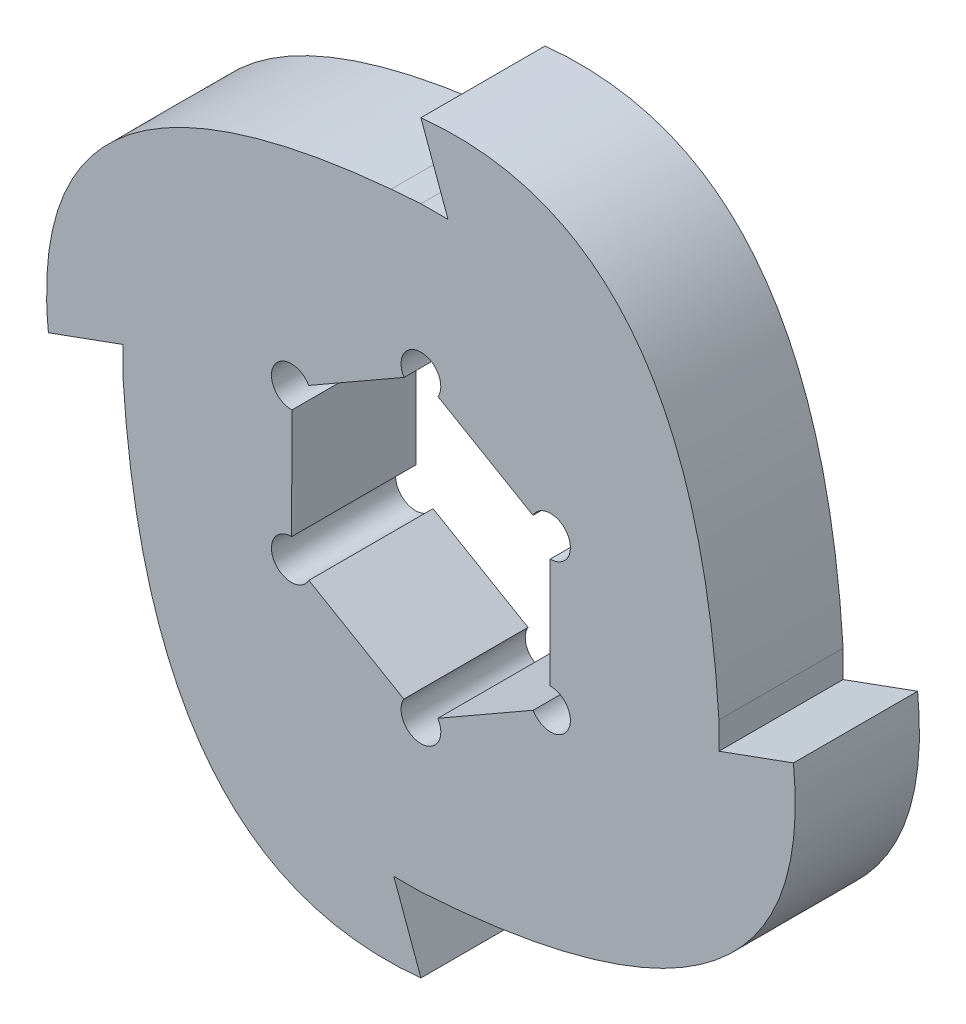
ISO-10303-21;
HEADER;
FILE_DESCRIPTION(('STEP AP214'),'2;1');
FILE_NAME('part.step','',(''),(''),'','','');
FILE_SCHEMA(('AUTOMOTIVE_DESIGN { 1 0 10303 214 1 1 1 1 }'));
ENDSEC;
DATA;
#1=APPLICATION_CONTEXT('core data for automotive mechanical design processes');
#2=APPLICATION_PROTOCOL_DEFINITION('international standard','automotive_design',2000,#1);
#3=PRODUCT_CONTEXT('',#1,'mechanical');
#4=PRODUCT('Part','Part','',(#3));
#5=PRODUCT_RELATED_PRODUCT_CATEGORY('part','',(#4));
#6=PRODUCT_DEFINITION_FORMATION('','',#4);
#7=PRODUCT_DEFINITION_CONTEXT('part definition',#1,'design');
#8=PRODUCT_DEFINITION('design','',#6,#7);
#9=PRODUCT_DEFINITION_SHAPE('','',#8);
#10=(LENGTH_UNIT() NAMED_UNIT(*) SI_UNIT(.MILLI.,.METRE.));
#11=(NAMED_UNIT(*) PLANE_ANGLE_UNIT() SI_UNIT($,.RADIAN.));
#12=(NAMED_UNIT(*) SI_UNIT($,.STERADIAN.) SOLID_ANGLE_UNIT());
#13=UNCERTAINTY_MEASURE_WITH_UNIT(LENGTH_MEASURE(1.E-05),#10,'distance_accuracy_value','');
#14=(GEOMETRIC_REPRESENTATION_CONTEXT(3) GLOBAL_UNCERTAINTY_ASSIGNED_CONTEXT((#13)) GLOBAL_UNIT_ASSIGNED_CONTEXT((#10,
#11,#12)) REPRESENTATION_CONTEXT('',''));
#15=CARTESIAN_POINT('',(0.,0.,0.));
#16=DIRECTION('',(0.,0.,1.));
#17=DIRECTION('',(1.,0.,0.));
#18=AXIS2_PLACEMENT_3D('',#15,#16,#17);
#19=CARTESIAN_POINT('',(0.,15.24,6.35));
#20=DIRECTION('',(0.,-1.,0.));
#21=DIRECTION('',(1.,0.,0.));
#22=AXIS2_PLACEMENT_3D('',#19,#20,#21);
#23=PLANE('',#22);
#24=DIRECTION('',(-1.,0.,0.));
#25=VECTOR('',#24,1.);
#26=CARTESIAN_POINT('',(0.,15.24,0.));
#27=LINE('',#26,#25);
#28=CARTESIAN_POINT('',(1.3867265925543,15.24,0.));
#29=VERTEX_POINT('',#28);
#30=CARTESIAN_POINT('',(0.,15.24,0.));
#31=VERTEX_POINT('',#30);
#32=EDGE_CURVE('E461',#29,#31,#27,.T.);
#33=ORIENTED_EDGE('',*,*,#32,.T.);
#34=DIRECTION('',(0.,0.,-1.));
#35=VECTOR('',#34,1.);
#36=CARTESIAN_POINT('',(0.,15.24,6.35));
#37=LINE('',#36,#35);
#38=CARTESIAN_POINT('',(0.,15.24,6.35));
#39=VERTEX_POINT('',#38);
#40=EDGE_CURVE('E12',#39,#31,#37,.T.);
#41=ORIENTED_EDGE('',*,*,#40,.F.);
#42=DIRECTION('',(-1.,0.,0.));
#43=VECTOR('',#42,1.);
#44=CARTESIAN_POINT('',(0.,15.24,6.35));
#45=LINE('',#44,#43);
#46=CARTESIAN_POINT('',(1.3867265925543,15.24,6.35));
#47=VERTEX_POINT('',#46);
#48=EDGE_CURVE('E659',#47,#39,#45,.T.);
#49=ORIENTED_EDGE('',*,*,#48,.F.);
#50=DIRECTION('',(0.,0.,-1.));
#51=VECTOR('',#50,1.);
#52=CARTESIAN_POINT('',(1.3867265925543,15.24,6.35));
#53=LINE('',#52,#51);
#54=EDGE_CURVE('E524',#47,#29,#53,.T.);
#55=ORIENTED_EDGE('',*,*,#54,.T.);
#56=EDGE_LOOP('',(#33,#41,#49,#55));
#57=FACE_BOUND('',#56,.T.);
#58=ADVANCED_FACE('F46',(#57),#23,.F.);
#59=CARTESIAN_POINT('',(0.,15.24,6.35));
#60=CARTESIAN_POINT('',(-20.4786192273312,13.932101613118,6.35));
#61=CARTESIAN_POINT('',(-19.05,-1.11367727944568E-13,6.35));
#62=B_SPLINE_CURVE_WITH_KNOTS('',2,(#59,#60,#61),.UNSPECIFIED.,.F.,.F.,(3,3),(0.,
0.635745988268557),.UNSPECIFIED.);
#63=DIRECTION('',(0.,0.,-1.));
#64=VECTOR('',#63,1.);
#65=SURFACE_OF_LINEAR_EXTRUSION('',#62,#64);
#66=CARTESIAN_POINT('',(0.,15.24,0.));
#67=CARTESIAN_POINT('',(-20.4786192273312,13.932101613118,0.));
#68=CARTESIAN_POINT('',(-19.05,-1.11367727944568E-13,0.));
#69=B_SPLINE_CURVE_WITH_KNOTS('',2,(#66,#67,#68),.UNSPECIFIED.,.F.,.F.,(3,3),(0.,
0.635745988268557),.UNSPECIFIED.);
#70=CARTESIAN_POINT('',(-1.52416502366941,15.1224227793508,0.));
#71=VERTEX_POINT('',#70);
#72=EDGE_CURVE('E465',#31,#71,#69,.T.);
#73=ORIENTED_EDGE('',*,*,#72,.T.);
#74=DIRECTION('',(0.,0.,-1.));
#75=VECTOR('',#74,1.);
#76=CARTESIAN_POINT('',(-1.52416502366941,15.1224227793508,6.35));
#77=LINE('',#76,#75);
#78=CARTESIAN_POINT('',(-1.52416502366941,15.1224227793508,6.35));
#79=VERTEX_POINT('',#78);
#80=EDGE_CURVE('E57',#79,#71,#77,.T.);
#81=ORIENTED_EDGE('',*,*,#80,.F.);
#82=EDGE_CURVE('E337',#39,#79,#62,.T.);
#83=ORIENTED_EDGE('',*,*,#82,.F.);
#84=ORIENTED_EDGE('',*,*,#40,.T.);
#85=EDGE_LOOP('',(#73,#81,#83,#84));
#86=FACE_BOUND('',#85,.T.);
#87=ADVANCED_FACE('F351',(#86),#65,.F.);
#88=CARTESIAN_POINT('',(-1.52416502366941,15.1224227793508,6.35));
#89=CARTESIAN_POINT('',(-14.1242901003145,13.9760649135802,6.35));
#90=CARTESIAN_POINT('',(-19.9662350924247,8.93525732046324,6.35));
#91=CARTESIAN_POINT('',(-19.05,0.,6.35));
#92=B_SPLINE_CURVE_WITH_KNOTS('',3,(#88,#89,#90,#91),.UNSPECIFIED.,.F.,.F.,(4,4),
(0.0241490282360042,0.635745988268557),.UNSPECIFIED.);
#93=DIRECTION('',(0.,0.,-1.));
#94=VECTOR('',#93,1.);
#95=SURFACE_OF_LINEAR_EXTRUSION('',#92,#94);
#96=CARTESIAN_POINT('',(-1.52416502366941,15.1224227793508,0.));
#97=CARTESIAN_POINT('',(-14.1242901003145,13.9760649135802,0.));
#98=CARTESIAN_POINT('',(-19.9662350924247,8.93525732046324,0.));
#99=CARTESIAN_POINT('',(-19.05,0.,0.));
#100=B_SPLINE_CURVE_WITH_KNOTS('',3,(#96,#97,#98,#99),.UNSPECIFIED.,.F.,.F.,(4,4),
(0.0241490282360042,0.635745988268557),.UNSPECIFIED.);
#101=CARTESIAN_POINT('',(-19.05,0.,0.));
#102=VERTEX_POINT('',#101);
#103=EDGE_CURVE('E470',#71,#102,#100,.T.);
#104=ORIENTED_EDGE('',*,*,#103,.T.);
#105=DIRECTION('',(0.,0.,-1.));
#106=VECTOR('',#105,1.);
#107=CARTESIAN_POINT('',(-19.05,0.,6.35));
#108=LINE('',#107,#106);
#109=CARTESIAN_POINT('',(-19.05,0.,6.35));
#110=VERTEX_POINT('',#109);
#111=EDGE_CURVE('E555',#110,#102,#108,.T.);
#112=ORIENTED_EDGE('',*,*,#111,.F.);
#113=EDGE_CURVE('E331',#79,#110,#92,.T.);
#114=ORIENTED_EDGE('',*,*,#113,.F.);
#115=ORIENTED_EDGE('',*,*,#80,.T.);
#116=EDGE_LOOP('',(#104,#112,#114,#115));
#117=FACE_BOUND('',#116,.T.);
#118=ADVANCED_FACE('F347',(#117),#95,.F.);
#119=CARTESIAN_POINT('',(-2.22842667929179,6.12255198226435,6.35));
#120=DIRECTION('',(-0.342020143325673,0.939692620785907,0.));
#121=DIRECTION('',(-0.939692620785907,-0.342020143325673,0.));
#122=AXIS2_PLACEMENT_3D('',#119,#120,#121);
#123=PLANE('',#122);
#124=DIRECTION('',(0.939692620785907,0.342020143325673,0.));
#125=VECTOR('',#124,1.);
#126=CARTESIAN_POINT('',(-2.22842667929179,6.12255198226435,0.));
#127=LINE('',#126,#125);
#128=CARTESIAN_POINT('',(-15.24,1.38672659255425,0.));
#129=VERTEX_POINT('',#128);
#130=EDGE_CURVE('E478',#102,#129,#127,.T.);
#131=ORIENTED_EDGE('',*,*,#130,.T.);
#132=DIRECTION('',(0.,0.,-1.));
#133=VECTOR('',#132,1.);
#134=CARTESIAN_POINT('',(-15.24,1.38672659255425,6.35));
#135=LINE('',#134,#133);
#136=CARTESIAN_POINT('',(-15.24,1.38672659255425,6.35));
#137=VERTEX_POINT('',#136);
#138=EDGE_CURVE('E551',#137,#129,#135,.T.);
#139=ORIENTED_EDGE('',*,*,#138,.F.);
#140=DIRECTION('',(0.939692620785907,0.342020143325673,0.));
#141=VECTOR('',#140,1.);
#142=CARTESIAN_POINT('',(-2.22842667929179,6.12255198226435,6.35));
#143=LINE('',#142,#141);
#144=EDGE_CURVE('E328',#110,#137,#143,.T.);
#145=ORIENTED_EDGE('',*,*,#144,.F.);
#146=ORIENTED_EDGE('',*,*,#111,.T.);
#147=EDGE_LOOP('',(#131,#139,#145,#146));
#148=FACE_BOUND('',#147,.T.);
#149=ADVANCED_FACE('F350',(#148),#123,.F.);
#150=CARTESIAN_POINT('',(-15.24,0.,6.35));
#151=DIRECTION('',(1.,0.,0.));
#152=DIRECTION('',(0.,1.,0.));
#153=AXIS2_PLACEMENT_3D('',#150,#151,#152);
#154=PLANE('',#153);
#155=DIRECTION('',(0.,-1.,0.));
#156=VECTOR('',#155,1.);
#157=CARTESIAN_POINT('',(-15.24,0.,0.));
#158=LINE('',#157,#156);
#159=CARTESIAN_POINT('',(-15.24,0.,0.));
#160=VERTEX_POINT('',#159);
#161=EDGE_CURVE('E484',#129,#160,#158,.T.);
#162=ORIENTED_EDGE('',*,*,#161,.T.);
#163=DIRECTION('',(0.,0.,-1.));
#164=VECTOR('',#163,1.);
#165=CARTESIAN_POINT('',(-15.24,0.,6.35));
#166=LINE('',#165,#164);
#167=CARTESIAN_POINT('',(-15.24,0.,6.35));
#168=VERTEX_POINT('',#167);
#169=EDGE_CURVE('E547',#168,#160,#166,.T.);
#170=ORIENTED_EDGE('',*,*,#169,.F.);
#171=DIRECTION('',(0.,-1.,0.));
#172=VECTOR('',#171,1.);
#173=CARTESIAN_POINT('',(-15.24,0.,6.35));
#174=LINE('',#173,#172);
#175=EDGE_CURVE('E313',#137,#168,#174,.T.);
#176=ORIENTED_EDGE('',*,*,#175,.F.);
#177=ORIENTED_EDGE('',*,*,#138,.T.);
#178=EDGE_LOOP('',(#162,#170,#176,#177));
#179=FACE_BOUND('',#178,.T.);
#180=ADVANCED_FACE('F303',(#179),#154,.F.);
#181=CARTESIAN_POINT('',(-15.24,0.,6.35));
#182=CARTESIAN_POINT('',(-13.932101613118,-20.4786192273313,6.35));
#183=CARTESIAN_POINT('',(1.11367727944568E-13,-19.05,6.35));
#184=B_SPLINE_CURVE_WITH_KNOTS('',2,(#181,#182,#183),.UNSPECIFIED.,.F.,.F.,(3,3),(0.,
0.635745988268557),.UNSPECIFIED.);
#185=DIRECTION('',(0.,0.,-1.));
#186=VECTOR('',#185,1.);
#187=SURFACE_OF_LINEAR_EXTRUSION('',#184,#186);
#188=CARTESIAN_POINT('',(-15.24,0.,0.));
#189=CARTESIAN_POINT('',(-13.932101613118,-20.4786192273313,0.));
#190=CARTESIAN_POINT('',(1.11367727944568E-13,-19.05,0.));
#191=B_SPLINE_CURVE_WITH_KNOTS('',2,(#188,#189,#190),.UNSPECIFIED.,.F.,.F.,(3,3),(0.,
0.635745988268557),.UNSPECIFIED.);
#192=CARTESIAN_POINT('',(0.,-19.05,0.));
#193=VERTEX_POINT('',#192);
#194=EDGE_CURVE('E487',#160,#193,#191,.T.);
#195=ORIENTED_EDGE('',*,*,#194,.T.);
#196=DIRECTION('',(0.,0.,-1.));
#197=VECTOR('',#196,1.);
#198=CARTESIAN_POINT('',(0.,-19.05,6.35));
#199=LINE('',#198,#197);
#200=CARTESIAN_POINT('',(0.,-19.05,6.35));
#201=VERTEX_POINT('',#200);
#202=EDGE_CURVE('E543',#201,#193,#199,.T.);
#203=ORIENTED_EDGE('',*,*,#202,.F.);
#204=EDGE_CURVE('E306',#168,#201,#184,.T.);
#205=ORIENTED_EDGE('',*,*,#204,.F.);
#206=ORIENTED_EDGE('',*,*,#169,.T.);
#207=EDGE_LOOP('',(#195,#203,#205,#206));
#208=FACE_BOUND('',#207,.T.);
#209=ADVANCED_FACE('F298',(#208),#187,.F.);
#210=CARTESIAN_POINT('',(-6.12255198226488,-2.22842667929223,6.35));
#211=DIRECTION('',(-0.939692620785894,-0.342020143325707,0.));
#212=DIRECTION('',(0.342020143325707,-0.939692620785895,0.));
#213=AXIS2_PLACEMENT_3D('',#210,#211,#212);
#214=PLANE('',#213);
#215=DIRECTION('',(-0.342020143325707,0.939692620785894,0.));
#216=VECTOR('',#215,1.);
#217=CARTESIAN_POINT('',(-6.12255198226488,-2.22842667929223,0.));
#218=LINE('',#217,#216);
#219=CARTESIAN_POINT('',(-1.38672659255441,-15.24,0.));
#220=VERTEX_POINT('',#219);
#221=EDGE_CURVE('E492',#193,#220,#218,.T.);
#222=ORIENTED_EDGE('',*,*,#221,.T.);
#223=DIRECTION('',(0.,0.,-1.));
#224=VECTOR('',#223,1.);
#225=CARTESIAN_POINT('',(-1.38672659255441,-15.24,6.35));
#226=LINE('',#225,#224);
#227=CARTESIAN_POINT('',(-1.38672659255441,-15.24,6.35));
#228=VERTEX_POINT('',#227);
#229=EDGE_CURVE('E539',#228,#220,#226,.T.);
#230=ORIENTED_EDGE('',*,*,#229,.F.);
#231=DIRECTION('',(-0.342020143325707,0.939692620785894,0.));
#232=VECTOR('',#231,1.);
#233=CARTESIAN_POINT('',(-6.12255198226488,-2.22842667929223,6.35));
#234=LINE('',#233,#232);
#235=EDGE_CURVE('E312',#201,#228,#234,.T.);
#236=ORIENTED_EDGE('',*,*,#235,.F.);
#237=ORIENTED_EDGE('',*,*,#202,.T.);
#238=EDGE_LOOP('',(#222,#230,#236,#237));
#239=FACE_BOUND('',#238,.T.);
#240=ADVANCED_FACE('F294',(#239),#214,.F.);
#241=CARTESIAN_POINT('',(-1.71580088852786E-13,-15.24,6.35));
#242=DIRECTION('',(0.,1.,0.));
#243=DIRECTION('',(-1.,0.,0.));
#244=AXIS2_PLACEMENT_3D('',#241,#242,#243);
#245=PLANE('',#244);
#246=DIRECTION('',(1.,0.,0.));
#247=VECTOR('',#246,1.);
#248=CARTESIAN_POINT('',(-1.71580088852786E-13,-15.24,0.));
#249=LINE('',#248,#247);
#250=CARTESIAN_POINT('',(-1.59630525227281E-13,-15.24,0.));
#251=VERTEX_POINT('',#250);
#252=EDGE_CURVE('E498',#220,#251,#249,.T.);
#253=ORIENTED_EDGE('',*,*,#252,.T.);
#254=DIRECTION('',(0.,0.,-1.));
#255=VECTOR('',#254,1.);
#256=CARTESIAN_POINT('',(-1.59630525227281E-13,-15.24,6.35));
#257=LINE('',#256,#255);
#258=CARTESIAN_POINT('',(-1.59630525227281E-13,-15.24,6.35));
#259=VERTEX_POINT('',#258);
#260=EDGE_CURVE('E535',#259,#251,#257,.T.);
#261=ORIENTED_EDGE('',*,*,#260,.F.);
#262=DIRECTION('',(1.,0.,0.));
#263=VECTOR('',#262,1.);
#264=CARTESIAN_POINT('',(-1.71580088852786E-13,-15.24,6.35));
#265=LINE('',#264,#263);
#266=EDGE_CURVE('E277',#228,#259,#265,.T.);
#267=ORIENTED_EDGE('',*,*,#266,.F.);
#268=ORIENTED_EDGE('',*,*,#229,.T.);
#269=EDGE_LOOP('',(#253,#261,#267,#268));
#270=FACE_BOUND('',#269,.T.);
#271=ADVANCED_FACE('F290',(#270),#245,.F.);
#272=CARTESIAN_POINT('',(0.,-15.24,6.35));
#273=CARTESIAN_POINT('',(20.4786192273311,-13.932101613118,6.35));
#274=CARTESIAN_POINT('',(19.05,1.11952145140775E-13,6.35));
#275=B_SPLINE_CURVE_WITH_KNOTS('',2,(#272,#273,#274),.UNSPECIFIED.,.F.,.F.,(3,3),(0.,
0.635745988268557),.UNSPECIFIED.);
#276=DIRECTION('',(0.,0.,-1.));
#277=VECTOR('',#276,1.);
#278=SURFACE_OF_LINEAR_EXTRUSION('',#275,#277);
#279=CARTESIAN_POINT('',(0.,-15.24,0.));
#280=CARTESIAN_POINT('',(20.4786192273311,-13.932101613118,0.));
#281=CARTESIAN_POINT('',(19.05,1.11952145140775E-13,0.));
#282=B_SPLINE_CURVE_WITH_KNOTS('',2,(#279,#280,#281),.UNSPECIFIED.,.F.,.F.,(3,3),(0.,
0.635745988268557),.UNSPECIFIED.);
#283=CARTESIAN_POINT('',(19.05,0.,0.));
#284=VERTEX_POINT('',#283);
#285=EDGE_CURVE('E501',#251,#284,#282,.T.);
#286=ORIENTED_EDGE('',*,*,#285,.T.);
#287=DIRECTION('',(0.,0.,-1.));
#288=VECTOR('',#287,1.);
#289=CARTESIAN_POINT('',(19.05,0.,6.35));
#290=LINE('',#289,#288);
#291=CARTESIAN_POINT('',(19.05,0.,6.35));
#292=VERTEX_POINT('',#291);
#293=EDGE_CURVE('E531',#292,#284,#290,.T.);
#294=ORIENTED_EDGE('',*,*,#293,.F.);
#295=EDGE_CURVE('E271',#259,#292,#275,.T.);
#296=ORIENTED_EDGE('',*,*,#295,.F.);
#297=ORIENTED_EDGE('',*,*,#260,.T.);
#298=EDGE_LOOP('',(#286,#294,#296,#297));
#299=FACE_BOUND('',#298,.T.);
#300=ADVANCED_FACE('F285',(#299),#278,.F.);
#301=CARTESIAN_POINT('',(2.22842667929208,-6.1225519822647,6.35));
#302=DIRECTION('',(0.342020143325696,-0.939692620785899,0.));
#303=DIRECTION('',(0.939692620785899,0.342020143325696,0.));
#304=AXIS2_PLACEMENT_3D('',#301,#302,#303);
#305=PLANE('',#304);
#306=DIRECTION('',(-0.939692620785899,-0.342020143325696,0.));
#307=VECTOR('',#306,1.);
#308=CARTESIAN_POINT('',(2.22842667929208,-6.1225519822647,0.));
#309=LINE('',#308,#307);
#310=CARTESIAN_POINT('',(15.24,-1.38672659255436,0.));
#311=VERTEX_POINT('',#310);
#312=EDGE_CURVE('E506',#284,#311,#309,.T.);
#313=ORIENTED_EDGE('',*,*,#312,.T.);
#314=DIRECTION('',(0.,0.,-1.));
#315=VECTOR('',#314,1.);
#316=CARTESIAN_POINT('',(15.24,-1.38672659255436,6.35));
#317=LINE('',#316,#315);
#318=CARTESIAN_POINT('',(15.24,-1.38672659255436,6.35));
#319=VERTEX_POINT('',#318);
#320=EDGE_CURVE('E242',#319,#311,#317,.T.);
#321=ORIENTED_EDGE('',*,*,#320,.F.);
#322=DIRECTION('',(-0.939692620785899,-0.342020143325696,0.));
#323=VECTOR('',#322,1.);
#324=CARTESIAN_POINT('',(2.22842667929208,-6.1225519822647,6.35));
#325=LINE('',#324,#323);
#326=EDGE_CURVE('E231',#292,#319,#325,.T.);
#327=ORIENTED_EDGE('',*,*,#326,.F.);
#328=ORIENTED_EDGE('',*,*,#293,.T.);
#329=EDGE_LOOP('',(#313,#321,#327,#328));
#330=FACE_BOUND('',#329,.T.);
#331=ADVANCED_FACE('F289',(#330),#305,.F.);
#332=CARTESIAN_POINT('',(15.24,-1.33451180218833E-13,6.35));
#333=DIRECTION('',(-1.,0.,0.));
#334=DIRECTION('',(0.,-1.,0.));
#335=AXIS2_PLACEMENT_3D('',#332,#333,#334);
#336=PLANE('',#335);
#337=DIRECTION('',(0.,1.,0.));
#338=VECTOR('',#337,1.);
#339=CARTESIAN_POINT('',(15.24,-1.33451180218833E-13,0.));
#340=LINE('',#339,#338);
#341=CARTESIAN_POINT('',(15.24,-1.06420353786144E-13,0.));
#342=VERTEX_POINT('',#341);
#343=EDGE_CURVE('E240',#311,#342,#340,.T.);
#344=ORIENTED_EDGE('',*,*,#343,.T.);
#345=DIRECTION('',(0.,0.,-1.));
#346=VECTOR('',#345,1.);
#347=CARTESIAN_POINT('',(15.24,-1.06420353786144E-13,6.35));
#348=LINE('',#347,#346);
#349=CARTESIAN_POINT('',(15.24,-1.06420353786144E-13,6.35));
#350=VERTEX_POINT('',#349);
#351=EDGE_CURVE('E237',#350,#342,#348,.T.);
#352=ORIENTED_EDGE('',*,*,#351,.F.);
#353=DIRECTION('',(0.,1.,0.));
#354=VECTOR('',#353,1.);
#355=CARTESIAN_POINT('',(15.24,-1.33451180218833E-13,6.35));
#356=LINE('',#355,#354);
#357=EDGE_CURVE('E225',#319,#350,#356,.T.);
#358=ORIENTED_EDGE('',*,*,#357,.F.);
#359=ORIENTED_EDGE('',*,*,#320,.T.);
#360=EDGE_LOOP('',(#344,#352,#358,#359));
#361=FACE_BOUND('',#360,.T.);
#362=ADVANCED_FACE('F238',(#361),#336,.F.);
#363=CARTESIAN_POINT('',(15.24,0.,6.35));
#364=CARTESIAN_POINT('',(13.932101613118,20.4786192273312,6.35));
#365=CARTESIAN_POINT('',(-1.1428509729315E-13,19.05,6.35));
#366=B_SPLINE_CURVE_WITH_KNOTS('',2,(#363,#364,#365),.UNSPECIFIED.,.F.,.F.,(3,3),(0.,
0.635745988268557),.UNSPECIFIED.);
#367=DIRECTION('',(0.,0.,-1.));
#368=VECTOR('',#367,1.);
#369=SURFACE_OF_LINEAR_EXTRUSION('',#366,#368);
#370=CARTESIAN_POINT('',(15.24,0.,0.));
#371=CARTESIAN_POINT('',(13.932101613118,20.4786192273312,0.));
#372=CARTESIAN_POINT('',(-1.1428509729315E-13,19.05,0.));
#373=B_SPLINE_CURVE_WITH_KNOTS('',2,(#370,#371,#372),.UNSPECIFIED.,.F.,.F.,(3,3),(0.,
0.635745988268557),.UNSPECIFIED.);
#374=CARTESIAN_POINT('',(0.,19.05,0.));
#375=VERTEX_POINT('',#374);
#376=EDGE_CURVE('E146',#342,#375,#373,.T.);
#377=ORIENTED_EDGE('',*,*,#376,.T.);
#378=DIRECTION('',(0.,0.,-1.));
#379=VECTOR('',#378,1.);
#380=CARTESIAN_POINT('',(0.,19.05,6.35));
#381=LINE('',#380,#379);
#382=CARTESIAN_POINT('',(0.,19.05,6.35));
#383=VERTEX_POINT('',#382);
#384=EDGE_CURVE('E243',#383,#375,#381,.T.);
#385=ORIENTED_EDGE('',*,*,#384,.F.);
#386=EDGE_CURVE('E229',#350,#383,#366,.T.);
#387=ORIENTED_EDGE('',*,*,#386,.F.);
#388=ORIENTED_EDGE('',*,*,#351,.T.);
#389=EDGE_LOOP('',(#377,#385,#387,#388));
#390=FACE_BOUND('',#389,.T.);
#391=ADVANCED_FACE('F245',(#390),#369,.F.);
#392=CARTESIAN_POINT('',(-6.62767759118328,-3.82649144137171,6.35));
#393=DIRECTION('',(0.,0.,-1.));
#394=DIRECTION('',(-1.,0.,0.));
#395=AXIS2_PLACEMENT_3D('',#392,#393,#394);
#396=CYLINDRICAL_SURFACE('',#395,1.016);
#397=CARTESIAN_POINT('',(-6.62767759118328,-3.82649144137171,0.));
#398=DIRECTION('',(0.,0.,1.));
#399=DIRECTION('',(1.,0.,0.));
#400=AXIS2_PLACEMENT_3D('',#397,#398,#399);
#401=CIRCLE('',#400,1.016);
#402=CARTESIAN_POINT('',(-6.61308201311803,-2.81059628482211,0.));
#403=VERTEX_POINT('',#402);
#404=CARTESIAN_POINT('',(-5.73190515362489,-4.30591582551451,0.));
#405=VERTEX_POINT('',#404);
#406=EDGE_CURVE('E416',#403,#405,#401,.T.);
#407=ORIENTED_EDGE('',*,*,#406,.F.);
#408=DIRECTION('',(0.,0.,-1.));
#409=VECTOR('',#408,1.);
#410=CARTESIAN_POINT('',(-6.61308201311803,-2.81059628482211,6.35));
#411=LINE('',#410,#409);
#412=CARTESIAN_POINT('',(-6.61308201311803,-2.81059628482211,6.35));
#413=VERTEX_POINT('',#412);
#414=EDGE_CURVE('E50',#413,#403,#411,.T.);
#415=ORIENTED_EDGE('',*,*,#414,.F.);
#416=CARTESIAN_POINT('',(-6.62767759118328,-3.82649144137171,6.35));
#417=DIRECTION('',(0.,0.,1.));
#418=DIRECTION('',(1.,0.,0.));
#419=AXIS2_PLACEMENT_3D('',#416,#417,#418);
#420=CIRCLE('',#419,1.016);
#421=CARTESIAN_POINT('',(-5.73190515362489,-4.30591582551451,6.35));
#422=VERTEX_POINT('',#421);
#423=EDGE_CURVE('E523',#413,#422,#420,.T.);
#424=ORIENTED_EDGE('',*,*,#423,.T.);
#425=DIRECTION('',(0.,0.,-1.));
#426=VECTOR('',#425,1.);
#427=CARTESIAN_POINT('',(-5.73190515362489,-4.30591582551451,6.35));
#428=LINE('',#427,#426);
#429=EDGE_CURVE('E249',#422,#405,#428,.T.);
#430=ORIENTED_EDGE('',*,*,#429,.T.);
#431=EDGE_LOOP('',(#407,#415,#424,#430));
#432=FACE_BOUND('',#431,.T.);
#433=ADVANCED_FACE('F48',(#432),#396,.F.);
#434=CARTESIAN_POINT('',(-6.60396578140302,0.0212593052107521,6.35));
#435=DIRECTION('',(0.999994818504394,-0.00321915584657058,0.));
#436=DIRECTION('',(0.00321915584657058,0.999994818504394,0.));
#437=AXIS2_PLACEMENT_3D('',#434,#435,#436);
#438=PLANE('',#437);
#439=DIRECTION('',(-0.00321915584657058,-0.999994818504394,0.));
#440=VECTOR('',#439,1.);
#441=CARTESIAN_POINT('',(-6.60396578140302,0.0212593052107521,0.));
#442=LINE('',#441,#440);
#443=CARTESIAN_POINT('',(-6.59498506826546,2.81101756236484,0.));
#444=VERTEX_POINT('',#443);
#445=EDGE_CURVE('E407',#444,#403,#442,.T.);
#446=ORIENTED_EDGE('',*,*,#445,.F.);
#447=DIRECTION('',(0.,0.,-1.));
#448=VECTOR('',#447,1.);
#449=CARTESIAN_POINT('',(-6.59498506826546,2.81101756236484,6.35));
#450=LINE('',#449,#448);
#451=CARTESIAN_POINT('',(-6.59498506826546,2.81101756236484,6.35));
#452=VERTEX_POINT('',#451);
#453=EDGE_CURVE('E410',#452,#444,#450,.T.);
#454=ORIENTED_EDGE('',*,*,#453,.F.);
#455=DIRECTION('',(-0.00321915584657058,-0.999994818504394,0.));
#456=VECTOR('',#455,1.);
#457=CARTESIAN_POINT('',(-6.60396578140302,0.0212593052107521,6.35));
#458=LINE('',#457,#456);
#459=EDGE_CURVE('E600',#452,#413,#458,.T.);
#460=ORIENTED_EDGE('',*,*,#459,.T.);
#461=ORIENTED_EDGE('',*,*,#414,.T.);
#462=EDGE_LOOP('',(#446,#454,#460,#461));
#463=FACE_BOUND('',#462,.T.);
#464=ADVANCED_FACE('F398',(#463),#438,.T.);
#465=CARTESIAN_POINT('',(-6.62767759118329,3.82649144137171,6.35));
#466=DIRECTION('',(0.,0.,-1.));
#467=DIRECTION('',(-1.,0.,0.));
#468=AXIS2_PLACEMENT_3D('',#465,#466,#467);
#469=CYLINDRICAL_SURFACE('',#468,1.016);
#470=CARTESIAN_POINT('',(-6.62767759118329,3.82649144137171,0.));
#471=DIRECTION('',(0.,0.,1.));
#472=DIRECTION('',(1.,0.,0.));
#473=AXIS2_PLACEMENT_3D('',#470,#471,#472);
#474=CIRCLE('',#473,1.016);
#475=CARTESIAN_POINT('',(-5.74058878899713,4.32179887825908,0.));
#476=VERTEX_POINT('',#475);
#477=EDGE_CURVE('E415',#476,#444,#474,.T.);
#478=ORIENTED_EDGE('',*,*,#477,.F.);
#479=DIRECTION('',(0.,0.,-1.));
#480=VECTOR('',#479,1.);
#481=CARTESIAN_POINT('',(-5.74058878899713,4.32179887825908,6.35));
#482=LINE('',#481,#480);
#483=CARTESIAN_POINT('',(-5.74058878899713,4.32179887825908,6.35));
#484=VERTEX_POINT('',#483);
#485=EDGE_CURVE('E588',#484,#476,#482,.T.);
#486=ORIENTED_EDGE('',*,*,#485,.F.);
#487=CARTESIAN_POINT('',(-6.62767759118329,3.82649144137171,6.35));
#488=DIRECTION('',(0.,0.,1.));
#489=DIRECTION('',(1.,0.,0.));
#490=AXIS2_PLACEMENT_3D('',#487,#488,#489);
#491=CIRCLE('',#490,1.016);
#492=EDGE_CURVE('E594',#484,#452,#491,.T.);
#493=ORIENTED_EDGE('',*,*,#492,.T.);
#494=ORIENTED_EDGE('',*,*,#453,.T.);
#495=EDGE_LOOP('',(#478,#486,#493,#494));
#496=FACE_BOUND('',#495,.T.);
#497=ADVANCED_FACE('F395',(#496),#469,.F.);
#498=CARTESIAN_POINT('',(-3.28357179232219,5.72983178502353,6.35));
#499=DIRECTION('',(0.497209538510327,-0.867630494400899,0.));
#500=DIRECTION('',(0.867630494400899,0.497209538510327,0.));
#501=AXIS2_PLACEMENT_3D('',#498,#499,#500);
#502=PLANE('',#501);
#503=DIRECTION('',(-0.867630494400899,-0.497209538510327,0.));
#504=VECTOR('',#503,1.);
#505=CARTESIAN_POINT('',(-3.28357179232219,5.72983178502353,0.));
#506=LINE('',#505,#504);
#507=CARTESIAN_POINT('',(-0.863079914640567,7.11693338787935,0.));
#508=VERTEX_POINT('',#507);
#509=EDGE_CURVE('E424',#508,#476,#506,.T.);
#510=ORIENTED_EDGE('',*,*,#509,.F.);
#511=DIRECTION('',(0.,0.,-1.));
#512=VECTOR('',#511,1.);
#513=CARTESIAN_POINT('',(-0.863079914640567,7.11693338787935,6.35));
#514=LINE('',#513,#512);
#515=CARTESIAN_POINT('',(-0.863079914640567,7.11693338787935,6.35));
#516=VERTEX_POINT('',#515);
#517=EDGE_CURVE('E585',#516,#508,#514,.T.);
#518=ORIENTED_EDGE('',*,*,#517,.F.);
#519=DIRECTION('',(-0.867630494400899,-0.497209538510327,0.));
#520=VECTOR('',#519,1.);
#521=CARTESIAN_POINT('',(-3.28357179232219,5.72983178502353,6.35));
#522=LINE('',#521,#520);
#523=EDGE_CURVE('E599',#516,#484,#522,.T.);
#524=ORIENTED_EDGE('',*,*,#523,.T.);
#525=ORIENTED_EDGE('',*,*,#485,.T.);
#526=EDGE_LOOP('',(#510,#518,#524,#525));
#527=FACE_BOUND('',#526,.T.);
#528=ADVANCED_FACE('F391',(#527),#502,.T.);
#529=CARTESIAN_POINT('',(0.,7.65298288274344,6.35));
#530=DIRECTION('',(0.,0.,-1.));
#531=DIRECTION('',(-1.,0.,0.));
#532=AXIS2_PLACEMENT_3D('',#529,#530,#531);
#533=CYLINDRICAL_SURFACE('',#532,1.016);
#534=CARTESIAN_POINT('',(0.,7.65298288274344,0.));
#535=DIRECTION('',(0.,0.,1.));
#536=DIRECTION('',(1.,0.,0.));
#537=AXIS2_PLACEMENT_3D('',#534,#535,#536);
#538=CIRCLE('',#537,1.016);
#539=CARTESIAN_POINT('',(0.87249322412089,7.13239516308121,0.));
#540=VERTEX_POINT('',#539);
#541=EDGE_CURVE('E428',#540,#508,#538,.T.);
#542=ORIENTED_EDGE('',*,*,#541,.F.);
#543=DIRECTION('',(0.,0.,-1.));
#544=VECTOR('',#543,1.);
#545=CARTESIAN_POINT('',(0.87249322412089,7.13239516308121,6.35));
#546=LINE('',#545,#544);
#547=CARTESIAN_POINT('',(0.87249322412089,7.13239516308121,6.35));
#548=VERTEX_POINT('',#547);
#549=EDGE_CURVE('E582',#548,#540,#546,.T.);
#550=ORIENTED_EDGE('',*,*,#549,.F.);
#551=CARTESIAN_POINT('',(0.,7.65298288274344,6.35));
#552=DIRECTION('',(0.,0.,1.));
#553=DIRECTION('',(1.,0.,0.));
#554=AXIS2_PLACEMENT_3D('',#551,#552,#553);
#555=CIRCLE('',#554,1.016);
#556=EDGE_CURVE('E604',#548,#516,#555,.T.);
#557=ORIENTED_EDGE('',*,*,#556,.T.);
#558=ORIENTED_EDGE('',*,*,#517,.T.);
#559=EDGE_LOOP('',(#542,#550,#557,#558));
#560=FACE_BOUND('',#559,.T.);
#561=ADVANCED_FACE('F387',(#560),#533,.F.);
#562=CARTESIAN_POINT('',(3.32039398908082,5.70857247981279,6.35));
#563=DIRECTION('',(-0.502785279994067,-0.864411338554329,0.));
#564=DIRECTION('',(0.86441133855433,-0.502785279994067,0.));
#565=AXIS2_PLACEMENT_3D('',#562,#563,#564);
#566=PLANE('',#565);
#567=DIRECTION('',(-0.864411338554329,0.502785279994067,0.));
#568=VECTOR('',#567,1.);
#569=CARTESIAN_POINT('',(3.32039398908082,5.70857247981279,0.));
#570=LINE('',#569,#568);
#571=CARTESIAN_POINT('',(5.73190515362489,4.30591582551452,0.));
#572=VERTEX_POINT('',#571);
#573=EDGE_CURVE('E433',#572,#540,#570,.T.);
#574=ORIENTED_EDGE('',*,*,#573,.F.);
#575=DIRECTION('',(0.,0.,-1.));
#576=VECTOR('',#575,1.);
#577=CARTESIAN_POINT('',(5.73190515362489,4.30591582551452,6.35));
#578=LINE('',#577,#576);
#579=CARTESIAN_POINT('',(5.73190515362489,4.30591582551452,6.35));
#580=VERTEX_POINT('',#579);
#581=EDGE_CURVE('E579',#580,#572,#578,.T.);
#582=ORIENTED_EDGE('',*,*,#581,.F.);
#583=DIRECTION('',(-0.864411338554329,0.502785279994067,0.));
#584=VECTOR('',#583,1.);
#585=CARTESIAN_POINT('',(3.32039398908082,5.70857247981279,6.35));
#586=LINE('',#585,#584);
#587=EDGE_CURVE('E623',#580,#548,#586,.T.);
#588=ORIENTED_EDGE('',*,*,#587,.T.);
#589=ORIENTED_EDGE('',*,*,#549,.T.);
#590=EDGE_LOOP('',(#574,#582,#588,#589));
#591=FACE_BOUND('',#590,.T.);
#592=ADVANCED_FACE('F383',(#591),#566,.T.);
#593=CARTESIAN_POINT('',(6.62767759118329,3.82649144137173,6.35));
#594=DIRECTION('',(0.,0.,-1.));
#595=DIRECTION('',(-1.,0.,0.));
#596=AXIS2_PLACEMENT_3D('',#593,#594,#595);
#597=CYLINDRICAL_SURFACE('',#596,1.016);
#598=CARTESIAN_POINT('',(6.62767759118329,3.82649144137173,0.));
#599=DIRECTION('',(0.,0.,1.));
#600=DIRECTION('',(1.,0.,0.));
#601=AXIS2_PLACEMENT_3D('',#598,#599,#600);
#602=CIRCLE('',#601,1.016);
#603=CARTESIAN_POINT('',(6.61308201311803,2.81059628482212,0.));
#604=VERTEX_POINT('',#603);
#605=EDGE_CURVE('E437',#604,#572,#602,.T.);
#606=ORIENTED_EDGE('',*,*,#605,.F.);
#607=DIRECTION('',(0.,0.,-1.));
#608=VECTOR('',#607,1.);
#609=CARTESIAN_POINT('',(6.61308201311803,2.81059628482212,6.35));
#610=LINE('',#609,#608);
#611=CARTESIAN_POINT('',(6.61308201311803,2.81059628482212,6.35));
#612=VERTEX_POINT('',#611);
#613=EDGE_CURVE('E576',#612,#604,#610,.T.);
#614=ORIENTED_EDGE('',*,*,#613,.F.);
#615=CARTESIAN_POINT('',(6.62767759118329,3.82649144137173,6.35));
#616=DIRECTION('',(0.,0.,1.));
#617=DIRECTION('',(1.,0.,0.));
#618=AXIS2_PLACEMENT_3D('',#615,#616,#617);
#619=CIRCLE('',#618,1.016);
#620=EDGE_CURVE('E628',#612,#580,#619,.T.);
#621=ORIENTED_EDGE('',*,*,#620,.T.);
#622=ORIENTED_EDGE('',*,*,#581,.T.);
#623=EDGE_LOOP('',(#606,#614,#621,#622));
#624=FACE_BOUND('',#623,.T.);
#625=ADVANCED_FACE('F379',(#624),#597,.F.);
#626=CARTESIAN_POINT('',(6.60396578140302,-0.02125930521075,6.35));
#627=DIRECTION('',(-0.999994818504394,0.00321915584657026,0.));
#628=DIRECTION('',(-0.00321915584657026,-0.999994818504394,0.));
#629=AXIS2_PLACEMENT_3D('',#626,#627,#628);
#630=PLANE('',#629);
#631=DIRECTION('',(0.00321915584657026,0.999994818504394,0.));
#632=VECTOR('',#631,1.);
#633=CARTESIAN_POINT('',(6.60396578140302,-0.02125930521075,0.));
#634=LINE('',#633,#632);
#635=CARTESIAN_POINT('',(6.59498506826546,-2.81101756236484,0.));
#636=VERTEX_POINT('',#635);
#637=EDGE_CURVE('E441',#636,#604,#634,.T.);
#638=ORIENTED_EDGE('',*,*,#637,.F.);
#639=DIRECTION('',(0.,0.,-1.));
#640=VECTOR('',#639,1.);
#641=CARTESIAN_POINT('',(6.59498506826546,-2.81101756236484,6.35));
#642=LINE('',#641,#640);
#643=CARTESIAN_POINT('',(6.59498506826546,-2.81101756236484,6.35));
#644=VERTEX_POINT('',#643);
#645=EDGE_CURVE('E573',#644,#636,#642,.T.);
#646=ORIENTED_EDGE('',*,*,#645,.F.);
#647=DIRECTION('',(0.00321915584657026,0.999994818504394,0.));
#648=VECTOR('',#647,1.);
#649=CARTESIAN_POINT('',(6.60396578140302,-0.02125930521075,6.35));
#650=LINE('',#649,#648);
#651=EDGE_CURVE('E633',#644,#612,#650,.T.);
#652=ORIENTED_EDGE('',*,*,#651,.T.);
#653=ORIENTED_EDGE('',*,*,#613,.T.);
#654=EDGE_LOOP('',(#638,#646,#652,#653));
#655=FACE_BOUND('',#654,.T.);
#656=ADVANCED_FACE('F375',(#655),#630,.T.);
#657=CARTESIAN_POINT('',(6.62767759118329,-3.82649144137172,6.35));
#658=DIRECTION('',(0.,0.,-1.));
#659=DIRECTION('',(-1.,0.,0.));
#660=AXIS2_PLACEMENT_3D('',#657,#658,#659);
#661=CYLINDRICAL_SURFACE('',#660,1.016);
#662=CARTESIAN_POINT('',(6.62767759118329,-3.82649144137172,0.));
#663=DIRECTION('',(0.,0.,1.));
#664=DIRECTION('',(1.,0.,0.));
#665=AXIS2_PLACEMENT_3D('',#662,#663,#664);
#666=CIRCLE('',#665,1.016);
#667=CARTESIAN_POINT('',(5.74058878899713,-4.32179887825908,0.));
#668=VERTEX_POINT('',#667);
#669=EDGE_CURVE('E445',#668,#636,#666,.T.);
#670=ORIENTED_EDGE('',*,*,#669,.F.);
#671=DIRECTION('',(0.,0.,-1.));
#672=VECTOR('',#671,1.);
#673=CARTESIAN_POINT('',(5.74058878899713,-4.32179887825908,6.35));
#674=LINE('',#673,#672);
#675=CARTESIAN_POINT('',(5.74058878899713,-4.32179887825908,6.35));
#676=VERTEX_POINT('',#675);
#677=EDGE_CURVE('E570',#676,#668,#674,.T.);
#678=ORIENTED_EDGE('',*,*,#677,.F.);
#679=CARTESIAN_POINT('',(6.62767759118329,-3.82649144137172,6.35));
#680=DIRECTION('',(0.,0.,1.));
#681=DIRECTION('',(1.,0.,0.));
#682=AXIS2_PLACEMENT_3D('',#679,#680,#681);
#683=CIRCLE('',#682,1.016);
#684=EDGE_CURVE('E641',#676,#644,#683,.T.);
#685=ORIENTED_EDGE('',*,*,#684,.T.);
#686=ORIENTED_EDGE('',*,*,#645,.T.);
#687=EDGE_LOOP('',(#670,#678,#685,#686));
#688=FACE_BOUND('',#687,.T.);
#689=ADVANCED_FACE('F371',(#688),#661,.F.);
#690=CARTESIAN_POINT('',(3.28357179232219,-5.72983178502353,6.35));
#691=DIRECTION('',(-0.497209538510326,0.867630494400899,0.));
#692=DIRECTION('',(-0.867630494400899,-0.497209538510326,0.));
#693=AXIS2_PLACEMENT_3D('',#690,#691,#692);
#694=PLANE('',#693);
#695=DIRECTION('',(0.867630494400899,0.497209538510326,0.));
#696=VECTOR('',#695,1.);
#697=CARTESIAN_POINT('',(3.28357179232219,-5.72983178502353,0.));
#698=LINE('',#697,#696);
#699=CARTESIAN_POINT('',(0.863079914640561,-7.11693338787935,0.));
#700=VERTEX_POINT('',#699);
#701=EDGE_CURVE('E449',#700,#668,#698,.T.);
#702=ORIENTED_EDGE('',*,*,#701,.F.);
#703=DIRECTION('',(0.,0.,-1.));
#704=VECTOR('',#703,1.);
#705=CARTESIAN_POINT('',(0.863079914640561,-7.11693338787935,6.35));
#706=LINE('',#705,#704);
#707=CARTESIAN_POINT('',(0.863079914640561,-7.11693338787935,6.35));
#708=VERTEX_POINT('',#707);
#709=EDGE_CURVE('E567',#708,#700,#706,.T.);
#710=ORIENTED_EDGE('',*,*,#709,.F.);
#711=DIRECTION('',(0.867630494400899,0.497209538510326,0.));
#712=VECTOR('',#711,1.);
#713=CARTESIAN_POINT('',(3.28357179232219,-5.72983178502353,6.35));
#714=LINE('',#713,#712);
#715=EDGE_CURVE('E645',#708,#676,#714,.T.);
#716=ORIENTED_EDGE('',*,*,#715,.T.);
#717=ORIENTED_EDGE('',*,*,#677,.T.);
#718=EDGE_LOOP('',(#702,#710,#716,#717));
#719=FACE_BOUND('',#718,.T.);
#720=ADVANCED_FACE('F367',(#719),#694,.T.);
#721=CARTESIAN_POINT('',(0.,-7.65298288274344,6.35));
#722=DIRECTION('',(0.,0.,-1.));
#723=DIRECTION('',(-1.,0.,0.));
#724=AXIS2_PLACEMENT_3D('',#721,#722,#723);
#725=CYLINDRICAL_SURFACE('',#724,1.016);
#726=CARTESIAN_POINT('',(0.,-7.65298288274344,0.));
#727=DIRECTION('',(0.,0.,1.));
#728=DIRECTION('',(1.,0.,0.));
#729=AXIS2_PLACEMENT_3D('',#726,#727,#728);
#730=CIRCLE('',#729,1.016);
#731=CARTESIAN_POINT('',(-0.872493224120894,-7.13239516308121,0.));
#732=VERTEX_POINT('',#731);
#733=EDGE_CURVE('E453',#732,#700,#730,.T.);
#734=ORIENTED_EDGE('',*,*,#733,.F.);
#735=DIRECTION('',(0.,0.,-1.));
#736=VECTOR('',#735,1.);
#737=CARTESIAN_POINT('',(-0.872493224120894,-7.13239516308121,6.35));
#738=LINE('',#737,#736);
#739=CARTESIAN_POINT('',(-0.872493224120894,-7.13239516308121,6.35));
#740=VERTEX_POINT('',#739);
#741=EDGE_CURVE('E564',#740,#732,#738,.T.);
#742=ORIENTED_EDGE('',*,*,#741,.F.);
#743=CARTESIAN_POINT('',(0.,-7.65298288274344,6.35));
#744=DIRECTION('',(0.,0.,1.));
#745=DIRECTION('',(1.,0.,0.));
#746=AXIS2_PLACEMENT_3D('',#743,#744,#745);
#747=CIRCLE('',#746,1.016);
#748=EDGE_CURVE('E650',#740,#708,#747,.T.);
#749=ORIENTED_EDGE('',*,*,#748,.T.);
#750=ORIENTED_EDGE('',*,*,#709,.T.);
#751=EDGE_LOOP('',(#734,#742,#749,#750));
#752=FACE_BOUND('',#751,.T.);
#753=ADVANCED_FACE('F363',(#752),#725,.F.);
#754=CARTESIAN_POINT('',(-3.32039398908083,-5.70857247981278,6.35));
#755=DIRECTION('',(0.502785279994068,0.864411338554329,0.));
#756=DIRECTION('',(-0.864411338554329,0.502785279994068,0.));
#757=AXIS2_PLACEMENT_3D('',#754,#755,#756);
#758=PLANE('',#757);
#759=DIRECTION('',(0.864411338554329,-0.502785279994068,0.));
#760=VECTOR('',#759,1.);
#761=CARTESIAN_POINT('',(-3.32039398908083,-5.70857247981278,0.));
#762=LINE('',#761,#760);
#763=EDGE_CURVE('E457',#405,#732,#762,.T.);
#764=ORIENTED_EDGE('',*,*,#763,.F.);
#765=ORIENTED_EDGE('',*,*,#429,.F.);
#766=DIRECTION('',(0.864411338554329,-0.502785279994068,0.));
#767=VECTOR('',#766,1.);
#768=CARTESIAN_POINT('',(-3.32039398908083,-5.70857247981278,6.35));
#769=LINE('',#768,#767);
#770=EDGE_CURVE('E655',#422,#740,#769,.T.);
#771=ORIENTED_EDGE('',*,*,#770,.T.);
#772=ORIENTED_EDGE('',*,*,#741,.T.);
#773=EDGE_LOOP('',(#764,#765,#771,#772));
#774=FACE_BOUND('',#773,.T.);
#775=ADVANCED_FACE('F359',(#774),#758,.T.);
#776=CARTESIAN_POINT('',(6.12255198226452,2.22842667929193,6.35));
#777=DIRECTION('',(0.939692620785903,0.342020143325684,0.));
#778=DIRECTION('',(-0.342020143325684,0.939692620785903,0.));
#779=AXIS2_PLACEMENT_3D('',#776,#777,#778);
#780=PLANE('',#779);
#781=DIRECTION('',(0.342020143325684,-0.939692620785903,0.));
#782=VECTOR('',#781,1.);
#783=CARTESIAN_POINT('',(6.12255198226452,2.22842667929193,0.));
#784=LINE('',#783,#782);
#785=EDGE_CURVE('E152',#375,#29,#784,.T.);
#786=ORIENTED_EDGE('',*,*,#785,.T.);
#787=ORIENTED_EDGE('',*,*,#54,.F.);
#788=DIRECTION('',(0.342020143325684,-0.939692620785903,0.));
#789=VECTOR('',#788,1.);
#790=CARTESIAN_POINT('',(6.12255198226452,2.22842667929193,6.35));
#791=LINE('',#790,#789);
#792=EDGE_CURVE('E66',#383,#47,#791,.T.);
#793=ORIENTED_EDGE('',*,*,#792,.F.);
#794=ORIENTED_EDGE('',*,*,#384,.T.);
#795=EDGE_LOOP('',(#786,#787,#793,#794));
#796=FACE_BOUND('',#795,.T.);
#797=ADVANCED_FACE('F362',(#796),#780,.F.);
#798=CARTESIAN_POINT('',(0.,0.,6.35));
#799=DIRECTION('',(0.,0.,1.));
#800=DIRECTION('',(1.,0.,0.));
#801=AXIS2_PLACEMENT_3D('',#798,#799,#800);
#802=PLANE('',#801);
#803=ORIENTED_EDGE('',*,*,#423,.F.);
#804=ORIENTED_EDGE('',*,*,#459,.F.);
#805=ORIENTED_EDGE('',*,*,#492,.F.);
#806=ORIENTED_EDGE('',*,*,#523,.F.);
#807=ORIENTED_EDGE('',*,*,#556,.F.);
#808=ORIENTED_EDGE('',*,*,#587,.F.);
#809=ORIENTED_EDGE('',*,*,#620,.F.);
#810=ORIENTED_EDGE('',*,*,#651,.F.);
#811=ORIENTED_EDGE('',*,*,#684,.F.);
#812=ORIENTED_EDGE('',*,*,#715,.F.);
#813=ORIENTED_EDGE('',*,*,#748,.F.);
#814=ORIENTED_EDGE('',*,*,#770,.F.);
#815=EDGE_LOOP('',(#803,#804,#805,#806,#807,#808,#809,#810,#811,#812,#813,#814));
#816=FACE_BOUND('',#815,.T.);
#817=ORIENTED_EDGE('',*,*,#48,.T.);
#818=ORIENTED_EDGE('',*,*,#82,.T.);
#819=ORIENTED_EDGE('',*,*,#113,.T.);
#820=ORIENTED_EDGE('',*,*,#144,.T.);
#821=ORIENTED_EDGE('',*,*,#175,.T.);
#822=ORIENTED_EDGE('',*,*,#204,.T.);
#823=ORIENTED_EDGE('',*,*,#235,.T.);
#824=ORIENTED_EDGE('',*,*,#266,.T.);
#825=ORIENTED_EDGE('',*,*,#295,.T.);
#826=ORIENTED_EDGE('',*,*,#326,.T.);
#827=ORIENTED_EDGE('',*,*,#357,.T.);
#828=ORIENTED_EDGE('',*,*,#386,.T.);
#829=ORIENTED_EDGE('',*,*,#792,.T.);
#830=EDGE_LOOP('',(#817,#818,#819,#820,#821,#822,#823,#824,#825,#826,#827,#828,#829));
#831=FACE_BOUND('',#830,.T.);
#832=ADVANCED_FACE('F227',(#816,#831),#802,.T.);
#833=CARTESIAN_POINT('',(0.,0.,0.));
#834=DIRECTION('',(0.,0.,1.));
#835=DIRECTION('',(1.,0.,0.));
#836=AXIS2_PLACEMENT_3D('',#833,#834,#835);
#837=PLANE('',#836);
#838=ORIENTED_EDGE('',*,*,#406,.T.);
#839=ORIENTED_EDGE('',*,*,#763,.T.);
#840=ORIENTED_EDGE('',*,*,#733,.T.);
#841=ORIENTED_EDGE('',*,*,#701,.T.);
#842=ORIENTED_EDGE('',*,*,#669,.T.);
#843=ORIENTED_EDGE('',*,*,#637,.T.);
#844=ORIENTED_EDGE('',*,*,#605,.T.);
#845=ORIENTED_EDGE('',*,*,#573,.T.);
#846=ORIENTED_EDGE('',*,*,#541,.T.);
#847=ORIENTED_EDGE('',*,*,#509,.T.);
#848=ORIENTED_EDGE('',*,*,#477,.T.);
#849=ORIENTED_EDGE('',*,*,#445,.T.);
#850=EDGE_LOOP('',(#838,#839,#840,#841,#842,#843,#844,#845,#846,#847,#848,#849));
#851=FACE_BOUND('',#850,.T.);
#852=ORIENTED_EDGE('',*,*,#32,.F.);
#853=ORIENTED_EDGE('',*,*,#785,.F.);
#854=ORIENTED_EDGE('',*,*,#376,.F.);
#855=ORIENTED_EDGE('',*,*,#343,.F.);
#856=ORIENTED_EDGE('',*,*,#312,.F.);
#857=ORIENTED_EDGE('',*,*,#285,.F.);
#858=ORIENTED_EDGE('',*,*,#252,.F.);
#859=ORIENTED_EDGE('',*,*,#221,.F.);
#860=ORIENTED_EDGE('',*,*,#194,.F.);
#861=ORIENTED_EDGE('',*,*,#161,.F.);
#862=ORIENTED_EDGE('',*,*,#130,.F.);
#863=ORIENTED_EDGE('',*,*,#103,.F.);
#864=ORIENTED_EDGE('',*,*,#72,.F.);
#865=EDGE_LOOP('',(#852,#853,#854,#855,#856,#857,#858,#859,#860,#861,#862,#863,#864));
#866=FACE_BOUND('',#865,.T.);
#867=ADVANCED_FACE('F420',(#851,#866),#837,.F.);
#868=CLOSED_SHELL('',(#58,#87,#118,#149,#180,#209,#240,#271,#300,#331,#362,#391,#433,#464,#497,
#528,#561,#592,#625,#656,#689,#720,#753,#775,#797,#832,#867));
#869=MANIFOLD_SOLID_BREP('B2',#868);
#870=ADVANCED_BREP_SHAPE_REPRESENTATION('',(#18,#869),#14);
#871=SHAPE_DEFINITION_REPRESENTATION(#9,#870);
ENDSEC;
END-ISO-10303-21;
